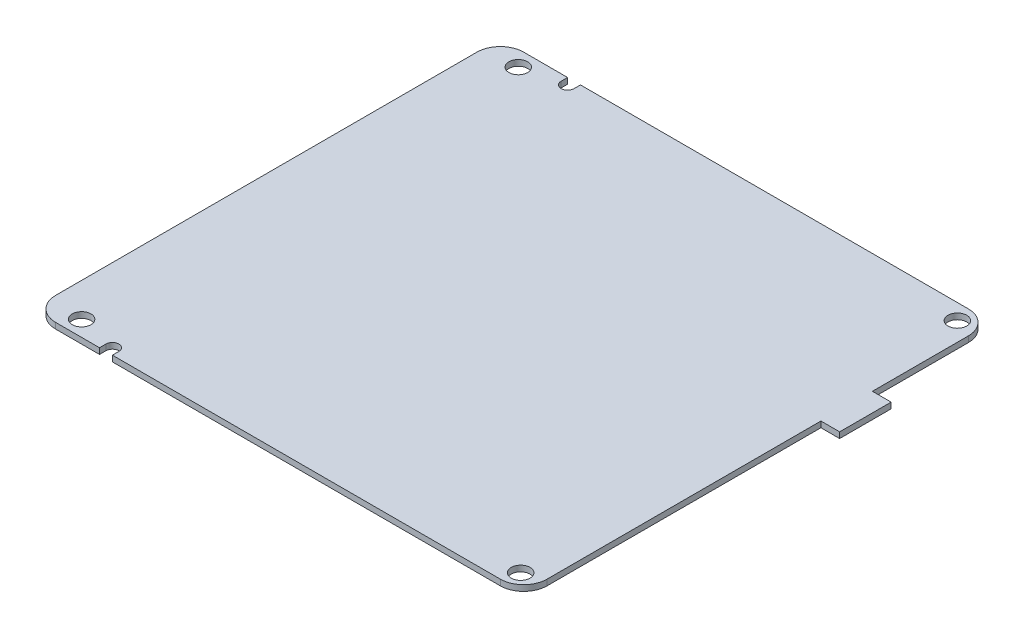
ISO-10303-21;
HEADER;
FILE_DESCRIPTION(('STEP AP214'),'2;1');
FILE_NAME('part.step','',(''),(''),'','','');
FILE_SCHEMA(('AUTOMOTIVE_DESIGN { 1 0 10303 214 1 1 1 1 }'));
ENDSEC;
DATA;
#1=APPLICATION_CONTEXT('core data for automotive mechanical design processes');
#2=APPLICATION_PROTOCOL_DEFINITION('international standard','automotive_design',2000,#1);
#3=PRODUCT_CONTEXT('',#1,'mechanical');
#4=PRODUCT('Part','Part','',(#3));
#5=PRODUCT_RELATED_PRODUCT_CATEGORY('part','',(#4));
#6=PRODUCT_DEFINITION_FORMATION('','',#4);
#7=PRODUCT_DEFINITION_CONTEXT('part definition',#1,'design');
#8=PRODUCT_DEFINITION('design','',#6,#7);
#9=PRODUCT_DEFINITION_SHAPE('','',#8);
#10=(LENGTH_UNIT() NAMED_UNIT(*) SI_UNIT(.MILLI.,.METRE.));
#11=(NAMED_UNIT(*) PLANE_ANGLE_UNIT() SI_UNIT($,.RADIAN.));
#12=(NAMED_UNIT(*) SI_UNIT($,.STERADIAN.) SOLID_ANGLE_UNIT());
#13=UNCERTAINTY_MEASURE_WITH_UNIT(LENGTH_MEASURE(1.E-05),#10,'distance_accuracy_value','');
#14=(GEOMETRIC_REPRESENTATION_CONTEXT(3) GLOBAL_UNCERTAINTY_ASSIGNED_CONTEXT((#13)) GLOBAL_UNIT_ASSIGNED_CONTEXT((#10,
#11,#12)) REPRESENTATION_CONTEXT('',''));
#15=CARTESIAN_POINT('',(0.,0.,0.));
#16=DIRECTION('',(0.,0.,1.));
#17=DIRECTION('',(1.,0.,0.));
#18=AXIS2_PLACEMENT_3D('',#15,#16,#17);
#19=CARTESIAN_POINT('',(0.,1.25,-50.));
#20=DIRECTION('',(0.,0.,-1.));
#21=DIRECTION('',(-1.,0.,0.));
#22=AXIS2_PLACEMENT_3D('',#19,#20,#21);
#23=PLANE('',#22);
#24=DIRECTION('',(1.,0.,0.));
#25=VECTOR('',#24,1.);
#26=CARTESIAN_POINT('',(0.,1.25,-50.));
#27=LINE('',#26,#25);
#28=CARTESIAN_POINT('',(-47.5,1.25,-50.));
#29=VERTEX_POINT('',#28);
#30=CARTESIAN_POINT('',(-38.125,1.25,-50.));
#31=VERTEX_POINT('',#30);
#32=EDGE_CURVE('E247',#29,#31,#27,.T.);
#33=ORIENTED_EDGE('',*,*,#32,.T.);
#34=DIRECTION('',(0.,1.,0.));
#35=VECTOR('',#34,1.);
#36=CARTESIAN_POINT('',(-38.125,-0.000999999999999916,-50.));
#37=LINE('',#36,#35);
#38=CARTESIAN_POINT('',(-38.125,0.,-50.));
#39=VERTEX_POINT('',#38);
#40=EDGE_CURVE('E199',#39,#31,#37,.T.);
#41=ORIENTED_EDGE('',*,*,#40,.F.);
#42=DIRECTION('',(1.,0.,0.));
#43=VECTOR('',#42,1.);
#44=CARTESIAN_POINT('',(0.,0.,-50.));
#45=LINE('',#44,#43);
#46=CARTESIAN_POINT('',(-47.5,0.,-50.));
#47=VERTEX_POINT('',#46);
#48=EDGE_CURVE('E269',#47,#39,#45,.T.);
#49=ORIENTED_EDGE('',*,*,#48,.F.);
#50=DIRECTION('',(0.,-1.,0.));
#51=VECTOR('',#50,1.);
#52=CARTESIAN_POINT('',(-47.5,1.25,-50.));
#53=LINE('',#52,#51);
#54=EDGE_CURVE('E311',#47,#29,#53,.F.);
#55=ORIENTED_EDGE('',*,*,#54,.T.);
#56=EDGE_LOOP('',(#33,#41,#49,#55));
#57=FACE_BOUND('',#56,.T.);
#58=ADVANCED_FACE('F35',(#57),#23,.T.);
#59=CARTESIAN_POINT('',(0.,1.25,50.));
#60=DIRECTION('',(0.,0.,-1.));
#61=DIRECTION('',(-1.,0.,0.));
#62=AXIS2_PLACEMENT_3D('',#59,#60,#61);
#63=PLANE('',#62);
#64=DIRECTION('',(0.,1.,0.));
#65=VECTOR('',#64,1.);
#66=CARTESIAN_POINT('',(-35.375,-0.000999999999999916,50.));
#67=LINE('',#66,#65);
#68=CARTESIAN_POINT('',(-35.375,0.,50.));
#69=VERTEX_POINT('',#68);
#70=CARTESIAN_POINT('',(-35.375,1.25,50.));
#71=VERTEX_POINT('',#70);
#72=EDGE_CURVE('E211',#69,#71,#67,.T.);
#73=ORIENTED_EDGE('',*,*,#72,.F.);
#74=DIRECTION('',(1.,0.,0.));
#75=VECTOR('',#74,1.);
#76=CARTESIAN_POINT('',(0.,0.,50.));
#77=LINE('',#76,#75);
#78=CARTESIAN_POINT('',(47.5,0.,50.));
#79=VERTEX_POINT('',#78);
#80=EDGE_CURVE('E275',#69,#79,#77,.T.);
#81=ORIENTED_EDGE('',*,*,#80,.T.);
#82=DIRECTION('',(0.,-1.,0.));
#83=VECTOR('',#82,1.);
#84=CARTESIAN_POINT('',(47.5,1.25,50.));
#85=LINE('',#84,#83);
#86=CARTESIAN_POINT('',(47.5,1.25,50.));
#87=VERTEX_POINT('',#86);
#88=EDGE_CURVE('E11',#79,#87,#85,.F.);
#89=ORIENTED_EDGE('',*,*,#88,.T.);
#90=DIRECTION('',(1.,0.,0.));
#91=VECTOR('',#90,1.);
#92=CARTESIAN_POINT('',(0.,1.25,50.));
#93=LINE('',#92,#91);
#94=EDGE_CURVE('E253',#71,#87,#93,.T.);
#95=ORIENTED_EDGE('',*,*,#94,.F.);
#96=EDGE_LOOP('',(#73,#81,#89,#95));
#97=FACE_BOUND('',#96,.T.);
#98=ADVANCED_FACE('F400',(#97),#63,.F.);
#99=CARTESIAN_POINT('',(0.,1.25,0.));
#100=DIRECTION('',(0.,1.,0.));
#101=DIRECTION('',(0.,0.,1.));
#102=AXIS2_PLACEMENT_3D('',#99,#100,#101);
#103=PLANE('',#102);
#104=CARTESIAN_POINT('',(48.5,1.25,46.65));
#105=DIRECTION('',(0.,1.,0.));
#106=DIRECTION('',(0.,0.,1.));
#107=AXIS2_PLACEMENT_3D('',#104,#105,#106);
#108=CIRCLE('',#107,2.);
#109=CARTESIAN_POINT('',(48.5,1.25,48.65));
#110=VERTEX_POINT('',#109);
#111=EDGE_CURVE('E625',#110,#110,#108,.F.);
#112=ORIENTED_EDGE('',*,*,#111,.T.);
#113=EDGE_LOOP('',(#112));
#114=FACE_BOUND('',#113,.T.);
#115=CARTESIAN_POINT('',(-36.75,1.25,48.625));
#116=DIRECTION('',(0.,1.,0.));
#117=DIRECTION('',(0.,0.,1.));
#118=AXIS2_PLACEMENT_3D('',#115,#116,#117);
#119=CIRCLE('',#118,1.375);
#120=CARTESIAN_POINT('',(-35.375,1.25,48.625));
#121=VERTEX_POINT('',#120);
#122=CARTESIAN_POINT('',(-38.125,1.25,48.625));
#123=VERTEX_POINT('',#122);
#124=EDGE_CURVE('E179',#121,#123,#119,.T.);
#125=ORIENTED_EDGE('',*,*,#124,.F.);
#126=DIRECTION('',(0.,0.,1.));
#127=VECTOR('',#126,1.);
#128=CARTESIAN_POINT('',(-35.375,1.25,0.));
#129=LINE('',#128,#127);
#130=EDGE_CURVE('E181',#121,#71,#129,.T.);
#131=ORIENTED_EDGE('',*,*,#130,.T.);
#132=ORIENTED_EDGE('',*,*,#94,.T.);
#133=CARTESIAN_POINT('',(47.5,1.25,45.));
#134=DIRECTION('',(0.,1.,0.));
#135=DIRECTION('',(0.,0.,1.));
#136=AXIS2_PLACEMENT_3D('',#133,#134,#135);
#137=CIRCLE('',#136,5.);
#138=CARTESIAN_POINT('',(52.5,1.25,45.));
#139=VERTEX_POINT('',#138);
#140=EDGE_CURVE('E315',#87,#139,#137,.T.);
#141=ORIENTED_EDGE('',*,*,#140,.T.);
#142=DIRECTION('',(0.,0.,1.));
#143=VECTOR('',#142,1.);
#144=CARTESIAN_POINT('',(52.5,1.25,0.));
#145=LINE('',#144,#143);
#146=CARTESIAN_POINT('',(52.5,1.25,-13.5));
#147=VERTEX_POINT('',#146);
#148=EDGE_CURVE('E246',#147,#139,#145,.T.);
#149=ORIENTED_EDGE('',*,*,#148,.F.);
#150=DIRECTION('',(1.,0.,0.));
#151=VECTOR('',#150,1.);
#152=CARTESIAN_POINT('',(0.,1.25,-13.5));
#153=LINE('',#152,#151);
#154=CARTESIAN_POINT('',(56.5,1.25,-13.5));
#155=VERTEX_POINT('',#154);
#156=EDGE_CURVE('E257',#147,#155,#153,.T.);
#157=ORIENTED_EDGE('',*,*,#156,.T.);
#158=DIRECTION('',(0.,0.,1.));
#159=VECTOR('',#158,1.);
#160=CARTESIAN_POINT('',(56.5,1.25,0.));
#161=LINE('',#160,#159);
#162=CARTESIAN_POINT('',(56.5,1.25,-24.5));
#163=VERTEX_POINT('',#162);
#164=EDGE_CURVE('E259',#163,#155,#161,.T.);
#165=ORIENTED_EDGE('',*,*,#164,.F.);
#166=DIRECTION('',(1.,0.,0.));
#167=VECTOR('',#166,1.);
#168=CARTESIAN_POINT('',(0.,1.25,-24.5));
#169=LINE('',#168,#167);
#170=CARTESIAN_POINT('',(52.5,1.25,-24.5));
#171=VERTEX_POINT('',#170);
#172=EDGE_CURVE('E262',#171,#163,#169,.T.);
#173=ORIENTED_EDGE('',*,*,#172,.F.);
#174=CARTESIAN_POINT('',(52.5,1.25,-45.));
#175=VERTEX_POINT('',#174);
#176=EDGE_CURVE('E242',#175,#171,#145,.T.);
#177=ORIENTED_EDGE('',*,*,#176,.F.);
#178=CARTESIAN_POINT('',(47.5,1.25,-45.));
#179=DIRECTION('',(0.,1.,0.));
#180=DIRECTION('',(0.,0.,1.));
#181=AXIS2_PLACEMENT_3D('',#178,#179,#180);
#182=CIRCLE('',#181,5.);
#183=CARTESIAN_POINT('',(47.5,1.25,-50.));
#184=VERTEX_POINT('',#183);
#185=EDGE_CURVE('E317',#175,#184,#182,.T.);
#186=ORIENTED_EDGE('',*,*,#185,.T.);
#187=CARTESIAN_POINT('',(-35.375,1.25,-50.));
#188=VERTEX_POINT('',#187);
#189=EDGE_CURVE('E244',#188,#184,#27,.T.);
#190=ORIENTED_EDGE('',*,*,#189,.F.);
#191=DIRECTION('',(0.,0.,-1.));
#192=VECTOR('',#191,1.);
#193=CARTESIAN_POINT('',(-35.375,1.25,0.));
#194=LINE('',#193,#192);
#195=CARTESIAN_POINT('',(-35.375,1.25,-48.625));
#196=VERTEX_POINT('',#195);
#197=EDGE_CURVE('E225',#196,#188,#194,.T.);
#198=ORIENTED_EDGE('',*,*,#197,.F.);
#199=CARTESIAN_POINT('',(-36.75,1.25,-48.625));
#200=DIRECTION('',(0.,1.,0.));
#201=DIRECTION('',(0.,0.,1.));
#202=AXIS2_PLACEMENT_3D('',#199,#200,#201);
#203=CIRCLE('',#202,1.375);
#204=CARTESIAN_POINT('',(-38.125,1.25,-48.625));
#205=VERTEX_POINT('',#204);
#206=EDGE_CURVE('E222',#196,#205,#203,.F.);
#207=ORIENTED_EDGE('',*,*,#206,.T.);
#208=DIRECTION('',(0.,0.,-1.));
#209=VECTOR('',#208,1.);
#210=CARTESIAN_POINT('',(-38.125,1.25,0.));
#211=LINE('',#210,#209);
#212=EDGE_CURVE('E219',#205,#31,#211,.T.);
#213=ORIENTED_EDGE('',*,*,#212,.T.);
#214=ORIENTED_EDGE('',*,*,#32,.F.);
#215=CARTESIAN_POINT('',(-47.5,1.25,-45.));
#216=DIRECTION('',(0.,1.,0.));
#217=DIRECTION('',(0.,0.,1.));
#218=AXIS2_PLACEMENT_3D('',#215,#216,#217);
#219=CIRCLE('',#218,5.);
#220=CARTESIAN_POINT('',(-52.5,1.25,-45.));
#221=VERTEX_POINT('',#220);
#222=EDGE_CURVE('E320',#29,#221,#219,.T.);
#223=ORIENTED_EDGE('',*,*,#222,.T.);
#224=DIRECTION('',(0.,0.,1.));
#225=VECTOR('',#224,1.);
#226=CARTESIAN_POINT('',(-52.5,1.25,0.));
#227=LINE('',#226,#225);
#228=CARTESIAN_POINT('',(-52.5,1.25,45.));
#229=VERTEX_POINT('',#228);
#230=EDGE_CURVE('E250',#221,#229,#227,.T.);
#231=ORIENTED_EDGE('',*,*,#230,.T.);
#232=CARTESIAN_POINT('',(-47.5,1.25,45.));
#233=DIRECTION('',(0.,1.,0.));
#234=DIRECTION('',(0.,0.,1.));
#235=AXIS2_PLACEMENT_3D('',#232,#233,#234);
#236=CIRCLE('',#235,5.);
#237=CARTESIAN_POINT('',(-47.5,1.25,50.));
#238=VERTEX_POINT('',#237);
#239=EDGE_CURVE('E313',#229,#238,#236,.T.);
#240=ORIENTED_EDGE('',*,*,#239,.T.);
#241=CARTESIAN_POINT('',(-38.125,1.25,50.));
#242=VERTEX_POINT('',#241);
#243=EDGE_CURVE('E254',#238,#242,#93,.T.);
#244=ORIENTED_EDGE('',*,*,#243,.T.);
#245=DIRECTION('',(0.,0.,1.));
#246=VECTOR('',#245,1.);
#247=CARTESIAN_POINT('',(-38.125,1.25,0.));
#248=LINE('',#247,#246);
#249=EDGE_CURVE('E206',#123,#242,#248,.T.);
#250=ORIENTED_EDGE('',*,*,#249,.F.);
#251=EDGE_LOOP('',(#125,#131,#132,#141,#149,#157,#165,#173,#177,#186,#190,#198,#207,#213,#214,
#223,#231,#240,#244,#250));
#252=FACE_BOUND('',#251,.T.);
#253=CARTESIAN_POINT('',(-45.3,1.25,-46.65));
#254=DIRECTION('',(0.,1.,0.));
#255=DIRECTION('',(0.,0.,1.));
#256=AXIS2_PLACEMENT_3D('',#253,#254,#255);
#257=CIRCLE('',#256,2.);
#258=CARTESIAN_POINT('',(-45.3,1.25,-44.65));
#259=VERTEX_POINT('',#258);
#260=EDGE_CURVE('E234',#259,#259,#257,.F.);
#261=ORIENTED_EDGE('',*,*,#260,.T.);
#262=EDGE_LOOP('',(#261));
#263=FACE_BOUND('',#262,.T.);
#264=CARTESIAN_POINT('',(-45.3,1.25,46.65));
#265=DIRECTION('',(0.,1.,0.));
#266=DIRECTION('',(0.,0.,1.));
#267=AXIS2_PLACEMENT_3D('',#264,#265,#266);
#268=CIRCLE('',#267,2.);
#269=CARTESIAN_POINT('',(-45.3,1.25,48.65));
#270=VERTEX_POINT('',#269);
#271=EDGE_CURVE('E188',#270,#270,#268,.T.);
#272=ORIENTED_EDGE('',*,*,#271,.F.);
#273=EDGE_LOOP('',(#272));
#274=FACE_BOUND('',#273,.T.);
#275=CARTESIAN_POINT('',(48.5,1.25,-46.65));
#276=DIRECTION('',(0.,1.,0.));
#277=DIRECTION('',(0.,0.,1.));
#278=AXIS2_PLACEMENT_3D('',#275,#276,#277);
#279=CIRCLE('',#278,2.);
#280=CARTESIAN_POINT('',(48.5,1.25,-44.65));
#281=VERTEX_POINT('',#280);
#282=EDGE_CURVE('E620',#281,#281,#279,.T.);
#283=ORIENTED_EDGE('',*,*,#282,.F.);
#284=EDGE_LOOP('',(#283));
#285=FACE_BOUND('',#284,.T.);
#286=ADVANCED_FACE('F340',(#114,#252,#263,#274,#285),#103,.T.);
#287=CARTESIAN_POINT('',(0.,0.,0.));
#288=DIRECTION('',(0.,1.,0.));
#289=DIRECTION('',(0.,0.,1.));
#290=AXIS2_PLACEMENT_3D('',#287,#288,#289);
#291=PLANE('',#290);
#292=CARTESIAN_POINT('',(-45.3,0.,46.65));
#293=DIRECTION('',(0.,1.,0.));
#294=DIRECTION('',(0.,0.,1.));
#295=AXIS2_PLACEMENT_3D('',#292,#293,#294);
#296=CIRCLE('',#295,2.);
#297=CARTESIAN_POINT('',(-45.3,0.,48.65));
#298=VERTEX_POINT('',#297);
#299=EDGE_CURVE('E202',#298,#298,#296,.F.);
#300=ORIENTED_EDGE('',*,*,#299,.F.);
#301=EDGE_LOOP('',(#300));
#302=FACE_BOUND('',#301,.T.);
#303=DIRECTION('',(0.,0.,-1.));
#304=VECTOR('',#303,1.);
#305=CARTESIAN_POINT('',(-35.375,0.,0.));
#306=LINE('',#305,#304);
#307=CARTESIAN_POINT('',(-35.375,0.,48.625));
#308=VERTEX_POINT('',#307);
#309=EDGE_CURVE('E194',#69,#308,#306,.T.);
#310=ORIENTED_EDGE('',*,*,#309,.T.);
#311=CARTESIAN_POINT('',(-36.75,0.,48.625));
#312=DIRECTION('',(0.,1.,0.));
#313=DIRECTION('',(0.,0.,1.));
#314=AXIS2_PLACEMENT_3D('',#311,#312,#313);
#315=CIRCLE('',#314,1.375);
#316=CARTESIAN_POINT('',(-38.125,0.,48.625));
#317=VERTEX_POINT('',#316);
#318=EDGE_CURVE('E176',#317,#308,#315,.F.);
#319=ORIENTED_EDGE('',*,*,#318,.F.);
#320=DIRECTION('',(0.,0.,-1.));
#321=VECTOR('',#320,1.);
#322=CARTESIAN_POINT('',(-38.125,0.,0.));
#323=LINE('',#322,#321);
#324=CARTESIAN_POINT('',(-38.125,0.,50.));
#325=VERTEX_POINT('',#324);
#326=EDGE_CURVE('E183',#325,#317,#323,.T.);
#327=ORIENTED_EDGE('',*,*,#326,.F.);
#328=CARTESIAN_POINT('',(-47.5,0.,50.));
#329=VERTEX_POINT('',#328);
#330=EDGE_CURVE('E276',#329,#325,#77,.T.);
#331=ORIENTED_EDGE('',*,*,#330,.F.);
#332=CARTESIAN_POINT('',(-47.5,0.,45.));
#333=DIRECTION('',(0.,1.,0.));
#334=DIRECTION('',(0.,0.,1.));
#335=AXIS2_PLACEMENT_3D('',#332,#333,#334);
#336=CIRCLE('',#335,5.);
#337=CARTESIAN_POINT('',(-52.5,0.,45.));
#338=VERTEX_POINT('',#337);
#339=EDGE_CURVE('E299',#329,#338,#336,.F.);
#340=ORIENTED_EDGE('',*,*,#339,.T.);
#341=DIRECTION('',(0.,0.,1.));
#342=VECTOR('',#341,1.);
#343=CARTESIAN_POINT('',(-52.5,0.,0.));
#344=LINE('',#343,#342);
#345=CARTESIAN_POINT('',(-52.5,0.,-45.));
#346=VERTEX_POINT('',#345);
#347=EDGE_CURVE('E272',#346,#338,#344,.T.);
#348=ORIENTED_EDGE('',*,*,#347,.F.);
#349=CARTESIAN_POINT('',(-47.5,0.,-45.));
#350=DIRECTION('',(0.,1.,0.));
#351=DIRECTION('',(0.,0.,1.));
#352=AXIS2_PLACEMENT_3D('',#349,#350,#351);
#353=CIRCLE('',#352,5.);
#354=EDGE_CURVE('E306',#346,#47,#353,.F.);
#355=ORIENTED_EDGE('',*,*,#354,.T.);
#356=ORIENTED_EDGE('',*,*,#48,.T.);
#357=DIRECTION('',(0.,0.,1.));
#358=VECTOR('',#357,1.);
#359=CARTESIAN_POINT('',(-38.125,0.,0.));
#360=LINE('',#359,#358);
#361=CARTESIAN_POINT('',(-38.125,0.,-48.625));
#362=VERTEX_POINT('',#361);
#363=EDGE_CURVE('E216',#39,#362,#360,.T.);
#364=ORIENTED_EDGE('',*,*,#363,.T.);
#365=CARTESIAN_POINT('',(-36.75,0.,-48.625));
#366=DIRECTION('',(0.,1.,0.));
#367=DIRECTION('',(0.,0.,1.));
#368=AXIS2_PLACEMENT_3D('',#365,#366,#367);
#369=CIRCLE('',#368,1.375);
#370=CARTESIAN_POINT('',(-35.375,0.,-48.625));
#371=VERTEX_POINT('',#370);
#372=EDGE_CURVE('E195',#362,#371,#369,.T.);
#373=ORIENTED_EDGE('',*,*,#372,.T.);
#374=DIRECTION('',(0.,0.,1.));
#375=VECTOR('',#374,1.);
#376=CARTESIAN_POINT('',(-35.375,0.,0.));
#377=LINE('',#376,#375);
#378=CARTESIAN_POINT('',(-35.375,0.,-50.));
#379=VERTEX_POINT('',#378);
#380=EDGE_CURVE('E214',#379,#371,#377,.T.);
#381=ORIENTED_EDGE('',*,*,#380,.F.);
#382=CARTESIAN_POINT('',(47.5,0.,-50.));
#383=VERTEX_POINT('',#382);
#384=EDGE_CURVE('E267',#379,#383,#45,.T.);
#385=ORIENTED_EDGE('',*,*,#384,.T.);
#386=CARTESIAN_POINT('',(47.5,0.,-45.));
#387=DIRECTION('',(0.,1.,0.));
#388=DIRECTION('',(0.,0.,1.));
#389=AXIS2_PLACEMENT_3D('',#386,#387,#388);
#390=CIRCLE('',#389,5.);
#391=CARTESIAN_POINT('',(52.5,0.,-45.));
#392=VERTEX_POINT('',#391);
#393=EDGE_CURVE('E304',#383,#392,#390,.F.);
#394=ORIENTED_EDGE('',*,*,#393,.T.);
#395=DIRECTION('',(0.,0.,1.));
#396=VECTOR('',#395,1.);
#397=CARTESIAN_POINT('',(52.5,0.,0.));
#398=LINE('',#397,#396);
#399=CARTESIAN_POINT('',(52.5,0.,-24.5));
#400=VERTEX_POINT('',#399);
#401=EDGE_CURVE('E237',#392,#400,#398,.T.);
#402=ORIENTED_EDGE('',*,*,#401,.T.);
#403=DIRECTION('',(1.,0.,0.));
#404=VECTOR('',#403,1.);
#405=CARTESIAN_POINT('',(0.,0.,-24.5));
#406=LINE('',#405,#404);
#407=CARTESIAN_POINT('',(56.5,0.,-24.5));
#408=VERTEX_POINT('',#407);
#409=EDGE_CURVE('E245',#400,#408,#406,.T.);
#410=ORIENTED_EDGE('',*,*,#409,.T.);
#411=DIRECTION('',(0.,0.,1.));
#412=VECTOR('',#411,1.);
#413=CARTESIAN_POINT('',(56.5,0.,0.));
#414=LINE('',#413,#412);
#415=CARTESIAN_POINT('',(56.5,0.,-13.5));
#416=VERTEX_POINT('',#415);
#417=EDGE_CURVE('E281',#408,#416,#414,.T.);
#418=ORIENTED_EDGE('',*,*,#417,.T.);
#419=DIRECTION('',(1.,0.,0.));
#420=VECTOR('',#419,1.);
#421=CARTESIAN_POINT('',(0.,0.,-13.5));
#422=LINE('',#421,#420);
#423=CARTESIAN_POINT('',(52.5,0.,-13.5));
#424=VERTEX_POINT('',#423);
#425=EDGE_CURVE('E278',#424,#416,#422,.T.);
#426=ORIENTED_EDGE('',*,*,#425,.F.);
#427=CARTESIAN_POINT('',(52.5,0.,45.));
#428=VERTEX_POINT('',#427);
#429=EDGE_CURVE('E268',#424,#428,#398,.T.);
#430=ORIENTED_EDGE('',*,*,#429,.T.);
#431=CARTESIAN_POINT('',(47.5,0.,45.));
#432=DIRECTION('',(0.,1.,0.));
#433=DIRECTION('',(0.,0.,1.));
#434=AXIS2_PLACEMENT_3D('',#431,#432,#433);
#435=CIRCLE('',#434,5.);
#436=EDGE_CURVE('E301',#428,#79,#435,.F.);
#437=ORIENTED_EDGE('',*,*,#436,.T.);
#438=ORIENTED_EDGE('',*,*,#80,.F.);
#439=EDGE_LOOP('',(#310,#319,#327,#331,#340,#348,#355,#356,#364,#373,#381,#385,#394,#402,#410,
#418,#426,#430,#437,#438));
#440=FACE_BOUND('',#439,.T.);
#441=CARTESIAN_POINT('',(-45.3,0.,-46.65));
#442=DIRECTION('',(0.,1.,0.));
#443=DIRECTION('',(0.,0.,1.));
#444=AXIS2_PLACEMENT_3D('',#441,#442,#443);
#445=CIRCLE('',#444,2.);
#446=CARTESIAN_POINT('',(-45.3,0.,-44.65));
#447=VERTEX_POINT('',#446);
#448=EDGE_CURVE('E238',#447,#447,#445,.T.);
#449=ORIENTED_EDGE('',*,*,#448,.T.);
#450=EDGE_LOOP('',(#449));
#451=FACE_BOUND('',#450,.T.);
#452=CARTESIAN_POINT('',(48.5,0.,46.65));
#453=DIRECTION('',(0.,1.,0.));
#454=DIRECTION('',(0.,0.,1.));
#455=AXIS2_PLACEMENT_3D('',#452,#453,#454);
#456=CIRCLE('',#455,2.);
#457=CARTESIAN_POINT('',(48.5,0.,48.65));
#458=VERTEX_POINT('',#457);
#459=EDGE_CURVE('E629',#458,#458,#456,.T.);
#460=ORIENTED_EDGE('',*,*,#459,.T.);
#461=EDGE_LOOP('',(#460));
#462=FACE_BOUND('',#461,.T.);
#463=CARTESIAN_POINT('',(48.5,0.,-46.65));
#464=DIRECTION('',(0.,1.,0.));
#465=DIRECTION('',(0.,0.,1.));
#466=AXIS2_PLACEMENT_3D('',#463,#464,#465);
#467=CIRCLE('',#466,2.);
#468=CARTESIAN_POINT('',(48.5,0.,-44.65));
#469=VERTEX_POINT('',#468);
#470=EDGE_CURVE('E241',#469,#469,#467,.F.);
#471=ORIENTED_EDGE('',*,*,#470,.F.);
#472=EDGE_LOOP('',(#471));
#473=FACE_BOUND('',#472,.T.);
#474=ADVANCED_FACE('F191',(#302,#440,#451,#462,#473),#291,.F.);
#475=CARTESIAN_POINT('',(52.5,1.25,0.));
#476=DIRECTION('',(1.,0.,0.));
#477=DIRECTION('',(0.,0.,-1.));
#478=AXIS2_PLACEMENT_3D('',#475,#476,#477);
#479=PLANE('',#478);
#480=ORIENTED_EDGE('',*,*,#401,.F.);
#481=DIRECTION('',(0.,-1.,0.));
#482=VECTOR('',#481,1.);
#483=CARTESIAN_POINT('',(52.5,1.25,-45.));
#484=LINE('',#483,#482);
#485=EDGE_CURVE('E322',#392,#175,#484,.F.);
#486=ORIENTED_EDGE('',*,*,#485,.T.);
#487=ORIENTED_EDGE('',*,*,#176,.T.);
#488=DIRECTION('',(0.,-1.,0.));
#489=VECTOR('',#488,1.);
#490=CARTESIAN_POINT('',(52.5,1.25,-24.5));
#491=LINE('',#490,#489);
#492=EDGE_CURVE('E265',#171,#400,#491,.T.);
#493=ORIENTED_EDGE('',*,*,#492,.T.);
#494=EDGE_LOOP('',(#480,#486,#487,#493));
#495=FACE_BOUND('',#494,.T.);
#496=ADVANCED_FACE('F370',(#495),#479,.T.);
#497=DIRECTION('',(0.,1.,0.));
#498=VECTOR('',#497,1.);
#499=CARTESIAN_POINT('',(-35.375,-0.000999999999999916,-50.));
#500=LINE('',#499,#498);
#501=EDGE_CURVE('E229',#379,#188,#500,.T.);
#502=ORIENTED_EDGE('',*,*,#501,.T.);
#503=ORIENTED_EDGE('',*,*,#189,.T.);
#504=DIRECTION('',(0.,-1.,0.));
#505=VECTOR('',#504,1.);
#506=CARTESIAN_POINT('',(47.5,1.25,-50.));
#507=LINE('',#506,#505);
#508=EDGE_CURVE('E308',#184,#383,#507,.T.);
#509=ORIENTED_EDGE('',*,*,#508,.T.);
#510=ORIENTED_EDGE('',*,*,#384,.F.);
#511=EDGE_LOOP('',(#502,#503,#509,#510));
#512=FACE_BOUND('',#511,.T.);
#513=ADVANCED_FACE('F362',(#512),#23,.T.);
#514=CARTESIAN_POINT('',(-52.5,1.25,0.));
#515=DIRECTION('',(1.,0.,0.));
#516=DIRECTION('',(0.,0.,-1.));
#517=AXIS2_PLACEMENT_3D('',#514,#515,#516);
#518=PLANE('',#517);
#519=ORIENTED_EDGE('',*,*,#230,.F.);
#520=DIRECTION('',(0.,-1.,0.));
#521=VECTOR('',#520,1.);
#522=CARTESIAN_POINT('',(-52.5,0.,-45.));
#523=LINE('',#522,#521);
#524=EDGE_CURVE('E296',#221,#346,#523,.T.);
#525=ORIENTED_EDGE('',*,*,#524,.T.);
#526=ORIENTED_EDGE('',*,*,#347,.T.);
#527=DIRECTION('',(0.,-1.,0.));
#528=VECTOR('',#527,1.);
#529=CARTESIAN_POINT('',(-52.5,1.25,45.));
#530=LINE('',#529,#528);
#531=EDGE_CURVE('E294',#338,#229,#530,.F.);
#532=ORIENTED_EDGE('',*,*,#531,.T.);
#533=EDGE_LOOP('',(#519,#525,#526,#532));
#534=FACE_BOUND('',#533,.T.);
#535=ADVANCED_FACE('F337',(#534),#518,.F.);
#536=ORIENTED_EDGE('',*,*,#330,.T.);
#537=DIRECTION('',(0.,1.,0.));
#538=VECTOR('',#537,1.);
#539=CARTESIAN_POINT('',(-38.125,-0.000999999999999916,50.));
#540=LINE('',#539,#538);
#541=EDGE_CURVE('E58',#325,#242,#540,.T.);
#542=ORIENTED_EDGE('',*,*,#541,.T.);
#543=ORIENTED_EDGE('',*,*,#243,.F.);
#544=DIRECTION('',(0.,-1.,0.));
#545=VECTOR('',#544,1.);
#546=CARTESIAN_POINT('',(-47.5,1.25,50.));
#547=LINE('',#546,#545);
#548=EDGE_CURVE('E43',#238,#329,#547,.T.);
#549=ORIENTED_EDGE('',*,*,#548,.T.);
#550=EDGE_LOOP('',(#536,#542,#543,#549));
#551=FACE_BOUND('',#550,.T.);
#552=ADVANCED_FACE('F330',(#551),#63,.F.);
#553=ORIENTED_EDGE('',*,*,#148,.T.);
#554=DIRECTION('',(0.,-1.,0.));
#555=VECTOR('',#554,1.);
#556=CARTESIAN_POINT('',(52.5,0.,45.));
#557=LINE('',#556,#555);
#558=EDGE_CURVE('E324',#139,#428,#557,.T.);
#559=ORIENTED_EDGE('',*,*,#558,.T.);
#560=ORIENTED_EDGE('',*,*,#429,.F.);
#561=DIRECTION('',(0.,-1.,0.));
#562=VECTOR('',#561,1.);
#563=CARTESIAN_POINT('',(52.5,1.25,-13.5));
#564=LINE('',#563,#562);
#565=EDGE_CURVE('E292',#147,#424,#564,.T.);
#566=ORIENTED_EDGE('',*,*,#565,.F.);
#567=EDGE_LOOP('',(#553,#559,#560,#566));
#568=FACE_BOUND('',#567,.T.);
#569=ADVANCED_FACE('F391',(#568),#479,.T.);
#570=CARTESIAN_POINT('',(0.,1.25,-13.5));
#571=DIRECTION('',(0.,0.,-1.));
#572=DIRECTION('',(-1.,0.,0.));
#573=AXIS2_PLACEMENT_3D('',#570,#571,#572);
#574=PLANE('',#573);
#575=ORIENTED_EDGE('',*,*,#425,.T.);
#576=DIRECTION('',(0.,-1.,0.));
#577=VECTOR('',#576,1.);
#578=CARTESIAN_POINT('',(56.5,1.25,-13.5));
#579=LINE('',#578,#577);
#580=EDGE_CURVE('E290',#155,#416,#579,.T.);
#581=ORIENTED_EDGE('',*,*,#580,.F.);
#582=ORIENTED_EDGE('',*,*,#156,.F.);
#583=ORIENTED_EDGE('',*,*,#565,.T.);
#584=EDGE_LOOP('',(#575,#581,#582,#583));
#585=FACE_BOUND('',#584,.T.);
#586=ADVANCED_FACE('F387',(#585),#574,.F.);
#587=CARTESIAN_POINT('',(56.5,1.25,0.));
#588=DIRECTION('',(1.,0.,0.));
#589=DIRECTION('',(0.,0.,-1.));
#590=AXIS2_PLACEMENT_3D('',#587,#588,#589);
#591=PLANE('',#590);
#592=ORIENTED_EDGE('',*,*,#417,.F.);
#593=DIRECTION('',(0.,-1.,0.));
#594=VECTOR('',#593,1.);
#595=CARTESIAN_POINT('',(56.5,1.25,-24.5));
#596=LINE('',#595,#594);
#597=EDGE_CURVE('E288',#163,#408,#596,.T.);
#598=ORIENTED_EDGE('',*,*,#597,.F.);
#599=ORIENTED_EDGE('',*,*,#164,.T.);
#600=ORIENTED_EDGE('',*,*,#580,.T.);
#601=EDGE_LOOP('',(#592,#598,#599,#600));
#602=FACE_BOUND('',#601,.T.);
#603=ADVANCED_FACE('F382',(#602),#591,.T.);
#604=CARTESIAN_POINT('',(0.,1.25,-24.5));
#605=DIRECTION('',(0.,0.,-1.));
#606=DIRECTION('',(-1.,0.,0.));
#607=AXIS2_PLACEMENT_3D('',#604,#605,#606);
#608=PLANE('',#607);
#609=ORIENTED_EDGE('',*,*,#409,.F.);
#610=ORIENTED_EDGE('',*,*,#492,.F.);
#611=ORIENTED_EDGE('',*,*,#172,.T.);
#612=ORIENTED_EDGE('',*,*,#597,.T.);
#613=EDGE_LOOP('',(#609,#610,#611,#612));
#614=FACE_BOUND('',#613,.T.);
#615=ADVANCED_FACE('F376',(#614),#608,.T.);
#616=CARTESIAN_POINT('',(-47.5,1.25,-45.));
#617=DIRECTION('',(0.,1.,0.));
#618=DIRECTION('',(0.,0.,1.));
#619=AXIS2_PLACEMENT_3D('',#616,#617,#618);
#620=CYLINDRICAL_SURFACE('',#619,5.);
#621=ORIENTED_EDGE('',*,*,#222,.F.);
#622=ORIENTED_EDGE('',*,*,#54,.F.);
#623=ORIENTED_EDGE('',*,*,#354,.F.);
#624=ORIENTED_EDGE('',*,*,#524,.F.);
#625=EDGE_LOOP('',(#621,#622,#623,#624));
#626=FACE_BOUND('',#625,.T.);
#627=ADVANCED_FACE('F345',(#626),#620,.T.);
#628=CARTESIAN_POINT('',(47.5,1.25,-45.));
#629=DIRECTION('',(0.,-1.,0.));
#630=DIRECTION('',(0.,0.,-1.));
#631=AXIS2_PLACEMENT_3D('',#628,#629,#630);
#632=CYLINDRICAL_SURFACE('',#631,5.);
#633=ORIENTED_EDGE('',*,*,#185,.F.);
#634=ORIENTED_EDGE('',*,*,#485,.F.);
#635=ORIENTED_EDGE('',*,*,#393,.F.);
#636=ORIENTED_EDGE('',*,*,#508,.F.);
#637=EDGE_LOOP('',(#633,#634,#635,#636));
#638=FACE_BOUND('',#637,.T.);
#639=ADVANCED_FACE('F366',(#638),#632,.T.);
#640=CARTESIAN_POINT('',(47.5,1.25,45.));
#641=DIRECTION('',(0.,1.,0.));
#642=DIRECTION('',(0.,0.,1.));
#643=AXIS2_PLACEMENT_3D('',#640,#641,#642);
#644=CYLINDRICAL_SURFACE('',#643,5.);
#645=ORIENTED_EDGE('',*,*,#140,.F.);
#646=ORIENTED_EDGE('',*,*,#88,.F.);
#647=ORIENTED_EDGE('',*,*,#436,.F.);
#648=ORIENTED_EDGE('',*,*,#558,.F.);
#649=EDGE_LOOP('',(#645,#646,#647,#648));
#650=FACE_BOUND('',#649,.T.);
#651=ADVANCED_FACE('F396',(#650),#644,.T.);
#652=CARTESIAN_POINT('',(-47.5,1.25,45.));
#653=DIRECTION('',(0.,-1.,0.));
#654=DIRECTION('',(0.,0.,-1.));
#655=AXIS2_PLACEMENT_3D('',#652,#653,#654);
#656=CYLINDRICAL_SURFACE('',#655,5.);
#657=ORIENTED_EDGE('',*,*,#239,.F.);
#658=ORIENTED_EDGE('',*,*,#531,.F.);
#659=ORIENTED_EDGE('',*,*,#339,.F.);
#660=ORIENTED_EDGE('',*,*,#548,.F.);
#661=EDGE_LOOP('',(#657,#658,#659,#660));
#662=FACE_BOUND('',#661,.T.);
#663=ADVANCED_FACE('F37',(#662),#656,.T.);
#664=CARTESIAN_POINT('',(-45.3,-0.000999999999999916,-46.65));
#665=DIRECTION('',(0.,1.,0.));
#666=DIRECTION('',(0.,0.,1.));
#667=AXIS2_PLACEMENT_3D('',#664,#665,#666);
#668=CYLINDRICAL_SURFACE('',#667,2.);
#669=ORIENTED_EDGE('',*,*,#260,.F.);
#670=EDGE_LOOP('',(#669));
#671=FACE_BOUND('',#670,.T.);
#672=ORIENTED_EDGE('',*,*,#448,.F.);
#673=EDGE_LOOP('',(#672));
#674=FACE_BOUND('',#673,.T.);
#675=ADVANCED_FACE('F488',(#671,#674),#668,.F.);
#676=CARTESIAN_POINT('',(-38.125,-0.000999999999999916,0.));
#677=DIRECTION('',(1.,0.,0.));
#678=DIRECTION('',(0.,0.,-1.));
#679=AXIS2_PLACEMENT_3D('',#676,#677,#678);
#680=PLANE('',#679);
#681=ORIENTED_EDGE('',*,*,#40,.T.);
#682=ORIENTED_EDGE('',*,*,#212,.F.);
#683=DIRECTION('',(0.,1.,0.));
#684=VECTOR('',#683,1.);
#685=CARTESIAN_POINT('',(-38.125,-0.000999999999999916,-48.625));
#686=LINE('',#685,#684);
#687=EDGE_CURVE('E227',#362,#205,#686,.T.);
#688=ORIENTED_EDGE('',*,*,#687,.F.);
#689=ORIENTED_EDGE('',*,*,#363,.F.);
#690=EDGE_LOOP('',(#681,#682,#688,#689));
#691=FACE_BOUND('',#690,.T.);
#692=ADVANCED_FACE('F352',(#691),#680,.T.);
#693=CARTESIAN_POINT('',(-35.375,-0.000999999999999916,0.));
#694=DIRECTION('',(1.,0.,0.));
#695=DIRECTION('',(0.,0.,-1.));
#696=AXIS2_PLACEMENT_3D('',#693,#694,#695);
#697=PLANE('',#696);
#698=ORIENTED_EDGE('',*,*,#380,.T.);
#699=DIRECTION('',(0.,1.,0.));
#700=VECTOR('',#699,1.);
#701=CARTESIAN_POINT('',(-35.375,-0.000999999999999916,-48.625));
#702=LINE('',#701,#700);
#703=EDGE_CURVE('E50',#371,#196,#702,.T.);
#704=ORIENTED_EDGE('',*,*,#703,.T.);
#705=ORIENTED_EDGE('',*,*,#197,.T.);
#706=ORIENTED_EDGE('',*,*,#501,.F.);
#707=EDGE_LOOP('',(#698,#704,#705,#706));
#708=FACE_BOUND('',#707,.T.);
#709=ADVANCED_FACE('F559',(#708),#697,.F.);
#710=CARTESIAN_POINT('',(-36.75,-0.000999999999999916,-48.625));
#711=DIRECTION('',(0.,1.,0.));
#712=DIRECTION('',(0.,0.,1.));
#713=AXIS2_PLACEMENT_3D('',#710,#711,#712);
#714=CYLINDRICAL_SURFACE('',#713,1.375);
#715=ORIENTED_EDGE('',*,*,#687,.T.);
#716=ORIENTED_EDGE('',*,*,#206,.F.);
#717=ORIENTED_EDGE('',*,*,#703,.F.);
#718=ORIENTED_EDGE('',*,*,#372,.F.);
#719=EDGE_LOOP('',(#715,#716,#717,#718));
#720=FACE_BOUND('',#719,.T.);
#721=ADVANCED_FACE('F356',(#720),#714,.F.);
#722=CARTESIAN_POINT('',(-36.75,-0.000999999999999916,48.625));
#723=DIRECTION('',(0.,1.,0.));
#724=DIRECTION('',(0.,0.,1.));
#725=AXIS2_PLACEMENT_3D('',#722,#723,#724);
#726=CYLINDRICAL_SURFACE('',#725,1.375);
#727=ORIENTED_EDGE('',*,*,#318,.T.);
#728=DIRECTION('',(0.,1.,0.));
#729=VECTOR('',#728,1.);
#730=CARTESIAN_POINT('',(-35.375,-0.000999999999999916,48.625));
#731=LINE('',#730,#729);
#732=EDGE_CURVE('E189',#308,#121,#731,.T.);
#733=ORIENTED_EDGE('',*,*,#732,.T.);
#734=ORIENTED_EDGE('',*,*,#124,.T.);
#735=DIRECTION('',(0.,1.,0.));
#736=VECTOR('',#735,1.);
#737=CARTESIAN_POINT('',(-38.125,-0.000999999999999916,48.625));
#738=LINE('',#737,#736);
#739=EDGE_CURVE('E173',#317,#123,#738,.T.);
#740=ORIENTED_EDGE('',*,*,#739,.F.);
#741=EDGE_LOOP('',(#727,#733,#734,#740));
#742=FACE_BOUND('',#741,.T.);
#743=ADVANCED_FACE('F174',(#742),#726,.F.);
#744=CARTESIAN_POINT('',(-35.375,-0.000999999999999916,0.));
#745=DIRECTION('',(-1.,0.,0.));
#746=DIRECTION('',(0.,0.,1.));
#747=AXIS2_PLACEMENT_3D('',#744,#745,#746);
#748=PLANE('',#747);
#749=ORIENTED_EDGE('',*,*,#72,.T.);
#750=ORIENTED_EDGE('',*,*,#130,.F.);
#751=ORIENTED_EDGE('',*,*,#732,.F.);
#752=ORIENTED_EDGE('',*,*,#309,.F.);
#753=EDGE_LOOP('',(#749,#750,#751,#752));
#754=FACE_BOUND('',#753,.T.);
#755=ADVANCED_FACE('F403',(#754),#748,.T.);
#756=CARTESIAN_POINT('',(-38.125,-0.000999999999999916,0.));
#757=DIRECTION('',(-1.,0.,0.));
#758=DIRECTION('',(0.,0.,1.));
#759=AXIS2_PLACEMENT_3D('',#756,#757,#758);
#760=PLANE('',#759);
#761=ORIENTED_EDGE('',*,*,#326,.T.);
#762=ORIENTED_EDGE('',*,*,#739,.T.);
#763=ORIENTED_EDGE('',*,*,#249,.T.);
#764=ORIENTED_EDGE('',*,*,#541,.F.);
#765=EDGE_LOOP('',(#761,#762,#763,#764));
#766=FACE_BOUND('',#765,.T.);
#767=ADVANCED_FACE('F184',(#766),#760,.F.);
#768=CARTESIAN_POINT('',(-45.3,-0.000999999999999916,46.65));
#769=DIRECTION('',(0.,1.,0.));
#770=DIRECTION('',(0.,0.,1.));
#771=AXIS2_PLACEMENT_3D('',#768,#769,#770);
#772=CYLINDRICAL_SURFACE('',#771,2.);
#773=ORIENTED_EDGE('',*,*,#271,.T.);
#774=EDGE_LOOP('',(#773));
#775=FACE_BOUND('',#774,.T.);
#776=ORIENTED_EDGE('',*,*,#299,.T.);
#777=EDGE_LOOP('',(#776));
#778=FACE_BOUND('',#777,.T.);
#779=ADVANCED_FACE('F410',(#775,#778),#772,.F.);
#780=CARTESIAN_POINT('',(48.5,-0.000999999999999916,46.65));
#781=DIRECTION('',(0.,1.,0.));
#782=DIRECTION('',(0.,0.,1.));
#783=AXIS2_PLACEMENT_3D('',#780,#781,#782);
#784=CYLINDRICAL_SURFACE('',#783,2.);
#785=ORIENTED_EDGE('',*,*,#111,.F.);
#786=EDGE_LOOP('',(#785));
#787=FACE_BOUND('',#786,.T.);
#788=ORIENTED_EDGE('',*,*,#459,.F.);
#789=EDGE_LOOP('',(#788));
#790=FACE_BOUND('',#789,.T.);
#791=ADVANCED_FACE('F594',(#787,#790),#784,.F.);
#792=CARTESIAN_POINT('',(48.5,-0.000999999999999916,-46.65));
#793=DIRECTION('',(0.,1.,0.));
#794=DIRECTION('',(0.,0.,1.));
#795=AXIS2_PLACEMENT_3D('',#792,#793,#794);
#796=CYLINDRICAL_SURFACE('',#795,2.);
#797=ORIENTED_EDGE('',*,*,#282,.T.);
#798=EDGE_LOOP('',(#797));
#799=FACE_BOUND('',#798,.T.);
#800=ORIENTED_EDGE('',*,*,#470,.T.);
#801=EDGE_LOOP('',(#800));
#802=FACE_BOUND('',#801,.T.);
#803=ADVANCED_FACE('F603',(#799,#802),#796,.F.);
#804=CLOSED_SHELL('',(#58,#98,#286,#474,#496,#513,#535,#552,#569,#586,#603,#615,#627,#639,#651,
#663,#675,#692,#709,#721,#743,#755,#767,#779,#791,#803));
#805=MANIFOLD_SOLID_BREP('B2',#804);
#806=ADVANCED_BREP_SHAPE_REPRESENTATION('',(#18,#805),#14);
#807=SHAPE_DEFINITION_REPRESENTATION(#9,#806);
ENDSEC;
END-ISO-10303-21;
